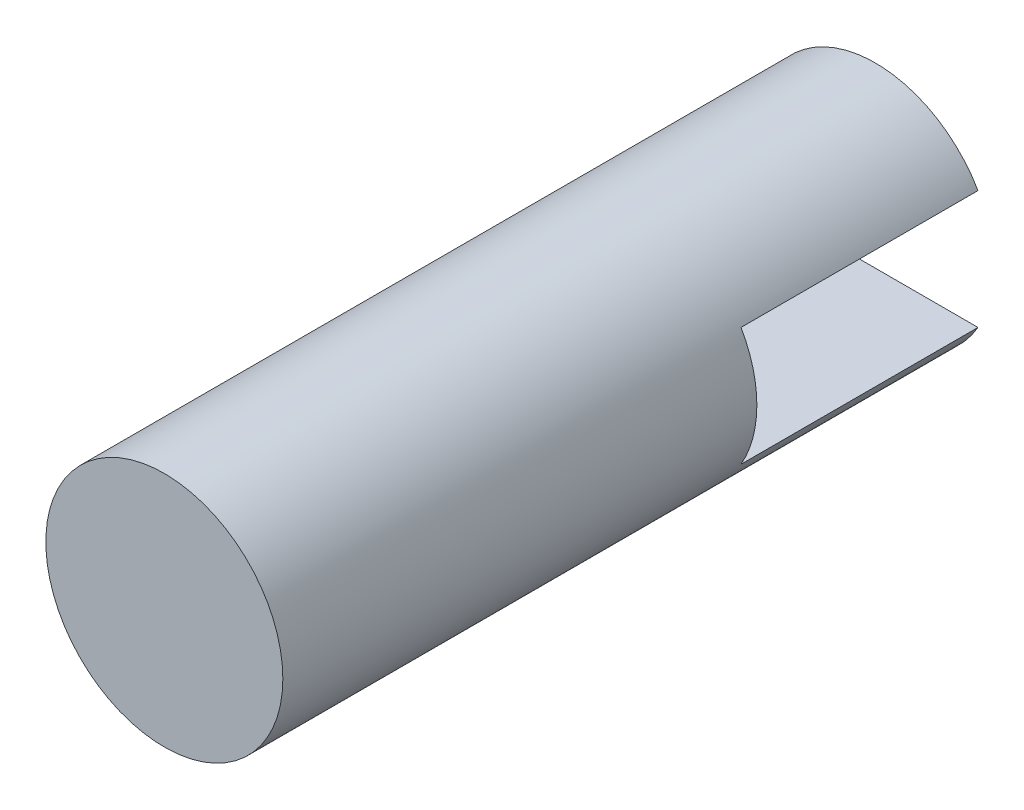
ISO-10303-21;
HEADER;
FILE_DESCRIPTION(('STEP AP214'),'2;1');
FILE_NAME('part.step','',(''),(''),'','','');
FILE_SCHEMA(('AUTOMOTIVE_DESIGN { 1 0 10303 214 1 1 1 1 }'));
ENDSEC;
DATA;
#1=APPLICATION_CONTEXT('core data for automotive mechanical design processes');
#2=APPLICATION_PROTOCOL_DEFINITION('international standard','automotive_design',2000,#1);
#3=PRODUCT_CONTEXT('',#1,'mechanical');
#4=PRODUCT('Part','Part','',(#3));
#5=PRODUCT_RELATED_PRODUCT_CATEGORY('part','',(#4));
#6=PRODUCT_DEFINITION_FORMATION('','',#4);
#7=PRODUCT_DEFINITION_CONTEXT('part definition',#1,'design');
#8=PRODUCT_DEFINITION('design','',#6,#7);
#9=PRODUCT_DEFINITION_SHAPE('','',#8);
#10=(LENGTH_UNIT() NAMED_UNIT(*) SI_UNIT(.MILLI.,.METRE.));
#11=(NAMED_UNIT(*) PLANE_ANGLE_UNIT() SI_UNIT($,.RADIAN.));
#12=(NAMED_UNIT(*) SI_UNIT($,.STERADIAN.) SOLID_ANGLE_UNIT());
#13=UNCERTAINTY_MEASURE_WITH_UNIT(LENGTH_MEASURE(1.E-05),#10,'distance_accuracy_value','');
#14=(GEOMETRIC_REPRESENTATION_CONTEXT(3) GLOBAL_UNCERTAINTY_ASSIGNED_CONTEXT((#13)) GLOBAL_UNIT_ASSIGNED_CONTEXT((#10,
#11,#12)) REPRESENTATION_CONTEXT('',''));
#15=CARTESIAN_POINT('',(0.,0.,0.));
#16=DIRECTION('',(0.,0.,1.));
#17=DIRECTION('',(1.,0.,0.));
#18=AXIS2_PLACEMENT_3D('',#15,#16,#17);
#19=CARTESIAN_POINT('',(0.,0.,-5.));
#20=DIRECTION('',(0.,0.,1.));
#21=DIRECTION('',(1.,0.,0.));
#22=AXIS2_PLACEMENT_3D('',#19,#20,#21);
#23=PLANE('',#22);
#24=CARTESIAN_POINT('',(0.,0.,-5.));
#25=DIRECTION('',(0.,0.,1.));
#26=DIRECTION('',(1.,0.,0.));
#27=AXIS2_PLACEMENT_3D('',#24,#25,#26);
#28=CIRCLE('',#27,5.);
#29=CARTESIAN_POINT('',(-4.3301270189222,-2.5,-5.));
#30=VERTEX_POINT('',#29);
#31=CARTESIAN_POINT('',(4.33012701892219,-2.5,-5.));
#32=VERTEX_POINT('',#31);
#33=EDGE_CURVE('E102',#30,#32,#28,.T.);
#34=ORIENTED_EDGE('',*,*,#33,.F.);
#35=DIRECTION('',(1.,0.,0.));
#36=VECTOR('',#35,1.);
#37=CARTESIAN_POINT('',(0.,-2.5,-5.));
#38=LINE('',#37,#36);
#39=EDGE_CURVE('E106',#30,#32,#38,.T.);
#40=ORIENTED_EDGE('',*,*,#39,.T.);
#41=EDGE_LOOP('',(#34,#40));
#42=FACE_BOUND('',#41,.T.);
#43=ADVANCED_FACE('F39',(#42),#23,.F.);
#44=CARTESIAN_POINT('',(0.,0.,-5.));
#45=DIRECTION('',(0.,0.,1.));
#46=DIRECTION('',(1.,0.,0.));
#47=AXIS2_PLACEMENT_3D('',#44,#45,#46);
#48=CYLINDRICAL_SURFACE('',#47,5.);
#49=DIRECTION('',(0.,0.,1.));
#50=VECTOR('',#49,1.);
#51=CARTESIAN_POINT('',(-4.3301270189222,-2.5,-5.));
#52=LINE('',#51,#50);
#53=CARTESIAN_POINT('',(-4.33012701892219,-2.5,5.));
#54=VERTEX_POINT('',#53);
#55=EDGE_CURVE('E92',#30,#54,#52,.T.);
#56=ORIENTED_EDGE('',*,*,#55,.F.);
#57=ORIENTED_EDGE('',*,*,#33,.T.);
#58=DIRECTION('',(0.,0.,1.));
#59=VECTOR('',#58,1.);
#60=CARTESIAN_POINT('',(4.3301270189222,-2.5,-5.));
#61=LINE('',#60,#59);
#62=CARTESIAN_POINT('',(4.33012701892219,-2.5,5.));
#63=VERTEX_POINT('',#62);
#64=EDGE_CURVE('E94',#63,#32,#61,.F.);
#65=ORIENTED_EDGE('',*,*,#64,.F.);
#66=CARTESIAN_POINT('',(0.,0.,5.));
#67=DIRECTION('',(0.,0.,1.));
#68=DIRECTION('',(0.,-1.,0.));
#69=AXIS2_PLACEMENT_3D('',#66,#67,#68);
#70=CIRCLE('',#69,5.);
#71=CARTESIAN_POINT('',(4.33012701892219,2.5,5.));
#72=VERTEX_POINT('',#71);
#73=EDGE_CURVE('E43',#72,#63,#70,.F.);
#74=ORIENTED_EDGE('',*,*,#73,.F.);
#75=DIRECTION('',(0.,0.,1.));
#76=VECTOR('',#75,1.);
#77=CARTESIAN_POINT('',(4.3301270189222,2.5,-5.));
#78=LINE('',#77,#76);
#79=CARTESIAN_POINT('',(4.33012701892219,2.5,-5.));
#80=VERTEX_POINT('',#79);
#81=EDGE_CURVE('E86',#80,#72,#78,.T.);
#82=ORIENTED_EDGE('',*,*,#81,.F.);
#83=CARTESIAN_POINT('',(-4.3301270189222,2.5,-5.));
#84=VERTEX_POINT('',#83);
#85=EDGE_CURVE('E91',#80,#84,#28,.T.);
#86=ORIENTED_EDGE('',*,*,#85,.T.);
#87=DIRECTION('',(0.,0.,1.));
#88=VECTOR('',#87,1.);
#89=CARTESIAN_POINT('',(-4.3301270189222,2.5,-5.));
#90=LINE('',#89,#88);
#91=CARTESIAN_POINT('',(-4.3301270189222,2.5,5.));
#92=VERTEX_POINT('',#91);
#93=EDGE_CURVE('E54',#92,#84,#90,.F.);
#94=ORIENTED_EDGE('',*,*,#93,.F.);
#95=EDGE_CURVE('E11',#54,#92,#70,.F.);
#96=ORIENTED_EDGE('',*,*,#95,.F.);
#97=EDGE_LOOP('',(#56,#57,#65,#74,#82,#86,#94,#96));
#98=FACE_BOUND('',#97,.T.);
#99=CARTESIAN_POINT('',(0.,0.,25.));
#100=DIRECTION('',(0.,0.,1.));
#101=DIRECTION('',(1.,0.,0.));
#102=AXIS2_PLACEMENT_3D('',#99,#100,#101);
#103=CIRCLE('',#102,5.);
#104=CARTESIAN_POINT('',(5.,0.,25.));
#105=VERTEX_POINT('',#104);
#106=EDGE_CURVE('E99',#105,#105,#103,.T.);
#107=ORIENTED_EDGE('',*,*,#106,.F.);
#108=EDGE_LOOP('',(#107));
#109=FACE_BOUND('',#108,.T.);
#110=ADVANCED_FACE('F41',(#98,#109),#48,.T.);
#111=ORIENTED_EDGE('',*,*,#85,.F.);
#112=DIRECTION('',(-1.,0.,0.));
#113=VECTOR('',#112,1.);
#114=CARTESIAN_POINT('',(0.,2.5,-5.));
#115=LINE('',#114,#113);
#116=EDGE_CURVE('E105',#80,#84,#115,.T.);
#117=ORIENTED_EDGE('',*,*,#116,.T.);
#118=EDGE_LOOP('',(#111,#117));
#119=FACE_BOUND('',#118,.T.);
#120=ADVANCED_FACE('F122',(#119),#23,.F.);
#121=CARTESIAN_POINT('',(0.,0.,25.));
#122=DIRECTION('',(0.,0.,1.));
#123=DIRECTION('',(1.,0.,0.));
#124=AXIS2_PLACEMENT_3D('',#121,#122,#123);
#125=PLANE('',#124);
#126=ORIENTED_EDGE('',*,*,#106,.T.);
#127=EDGE_LOOP('',(#126));
#128=FACE_BOUND('',#127,.T.);
#129=ADVANCED_FACE('F115',(#128),#125,.T.);
#130=CARTESIAN_POINT('',(-5.,-2.5,-5.));
#131=DIRECTION('',(0.,-1.,0.));
#132=DIRECTION('',(0.,0.,-1.));
#133=AXIS2_PLACEMENT_3D('',#130,#131,#132);
#134=PLANE('',#133);
#135=ORIENTED_EDGE('',*,*,#64,.T.);
#136=ORIENTED_EDGE('',*,*,#39,.F.);
#137=ORIENTED_EDGE('',*,*,#55,.T.);
#138=DIRECTION('',(1.,0.,0.));
#139=VECTOR('',#138,1.);
#140=CARTESIAN_POINT('',(-5.,-2.5,5.));
#141=LINE('',#140,#139);
#142=EDGE_CURVE('E79',#54,#63,#141,.T.);
#143=ORIENTED_EDGE('',*,*,#142,.T.);
#144=EDGE_LOOP('',(#135,#136,#137,#143));
#145=FACE_BOUND('',#144,.T.);
#146=ADVANCED_FACE('F112',(#145),#134,.F.);
#147=CARTESIAN_POINT('',(-5.,-2.5,5.));
#148=DIRECTION('',(0.,0.,1.));
#149=DIRECTION('',(0.,-1.,0.));
#150=AXIS2_PLACEMENT_3D('',#147,#148,#149);
#151=PLANE('',#150);
#152=ORIENTED_EDGE('',*,*,#142,.F.);
#153=ORIENTED_EDGE('',*,*,#95,.T.);
#154=DIRECTION('',(1.,0.,0.));
#155=VECTOR('',#154,1.);
#156=CARTESIAN_POINT('',(-5.,2.5,5.));
#157=LINE('',#156,#155);
#158=EDGE_CURVE('E78',#92,#72,#157,.T.);
#159=ORIENTED_EDGE('',*,*,#158,.T.);
#160=ORIENTED_EDGE('',*,*,#73,.T.);
#161=EDGE_LOOP('',(#152,#153,#159,#160));
#162=FACE_BOUND('',#161,.T.);
#163=ADVANCED_FACE('F77',(#162),#151,.F.);
#164=CARTESIAN_POINT('',(-5.,2.5,-5.));
#165=DIRECTION('',(0.,1.,0.));
#166=DIRECTION('',(0.,0.,1.));
#167=AXIS2_PLACEMENT_3D('',#164,#165,#166);
#168=PLANE('',#167);
#169=ORIENTED_EDGE('',*,*,#93,.T.);
#170=ORIENTED_EDGE('',*,*,#116,.F.);
#171=ORIENTED_EDGE('',*,*,#81,.T.);
#172=ORIENTED_EDGE('',*,*,#158,.F.);
#173=EDGE_LOOP('',(#169,#170,#171,#172));
#174=FACE_BOUND('',#173,.T.);
#175=ADVANCED_FACE('F84',(#174),#168,.F.);
#176=CLOSED_SHELL('',(#43,#110,#120,#129,#146,#163,#175));
#177=MANIFOLD_SOLID_BREP('B2',#176);
#178=ADVANCED_BREP_SHAPE_REPRESENTATION('',(#18,#177),#14);
#179=SHAPE_DEFINITION_REPRESENTATION(#9,#178);
ENDSEC;
END-ISO-10303-21;
